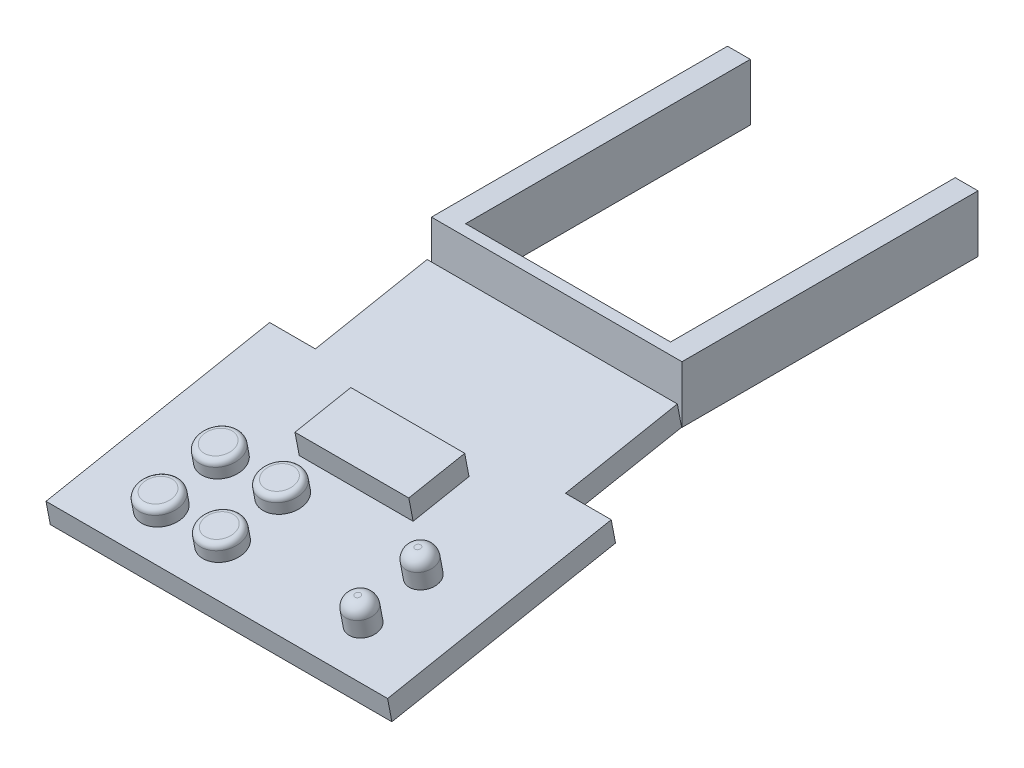
ISO-10303-21;
HEADER;
FILE_DESCRIPTION(('STEP AP214'),'2;1');
FILE_NAME('part.step','',(''),(''),'','','');
FILE_SCHEMA(('AUTOMOTIVE_DESIGN { 1 0 10303 214 1 1 1 1 }'));
ENDSEC;
DATA;
#1=APPLICATION_CONTEXT('core data for automotive mechanical design processes');
#2=APPLICATION_PROTOCOL_DEFINITION('international standard','automotive_design',2000,#1);
#3=PRODUCT_CONTEXT('',#1,'mechanical');
#4=PRODUCT('Part','Part','',(#3));
#5=PRODUCT_RELATED_PRODUCT_CATEGORY('part','',(#4));
#6=PRODUCT_DEFINITION_FORMATION('','',#4);
#7=PRODUCT_DEFINITION_CONTEXT('part definition',#1,'design');
#8=PRODUCT_DEFINITION('design','',#6,#7);
#9=PRODUCT_DEFINITION_SHAPE('','',#8);
#10=(LENGTH_UNIT() NAMED_UNIT(*) SI_UNIT(.MILLI.,.METRE.));
#11=(NAMED_UNIT(*) PLANE_ANGLE_UNIT() SI_UNIT($,.RADIAN.));
#12=(NAMED_UNIT(*) SI_UNIT($,.STERADIAN.) SOLID_ANGLE_UNIT());
#13=UNCERTAINTY_MEASURE_WITH_UNIT(LENGTH_MEASURE(1.E-05),#10,'distance_accuracy_value','');
#14=(GEOMETRIC_REPRESENTATION_CONTEXT(3) GLOBAL_UNCERTAINTY_ASSIGNED_CONTEXT((#13)) GLOBAL_UNIT_ASSIGNED_CONTEXT((#10,
#11,#12)) REPRESENTATION_CONTEXT('',''));
#15=CARTESIAN_POINT('',(0.,0.,0.));
#16=DIRECTION('',(0.,0.,1.));
#17=DIRECTION('',(1.,0.,0.));
#18=AXIS2_PLACEMENT_3D('',#15,#16,#17);
#19=CARTESIAN_POINT('',(0.,9.26484620320237,1.78170119292353));
#20=DIRECTION('',(0.,0.982006446980648,0.188847393650125));
#21=DIRECTION('',(0.,-0.188847393650124,0.982006446980647));
#22=AXIS2_PLACEMENT_3D('',#19,#20,#21);
#23=PLANE('',#22);
#24=CARTESIAN_POINT('',(18.0023654325447,-3.89618109443994,70.2190431406636));
#25=DIRECTION('',(0.,0.982006446980647,0.188847393650124));
#26=DIRECTION('',(0.,-0.188847393650124,0.982006446980647));
#27=AXIS2_PLACEMENT_3D('',#24,#25,#26);
#28=CIRCLE('',#27,2.5);
#29=CARTESIAN_POINT('',(18.0023654325447,-4.36829957856525,72.6740592581152));
#30=VERTEX_POINT('',#29);
#31=EDGE_CURVE('E590',#30,#30,#28,.T.);
#32=ORIENTED_EDGE('',*,*,#31,.F.);
#33=EDGE_LOOP('',(#32));
#34=FACE_BOUND('',#33,.T.);
#35=CARTESIAN_POINT('',(18.0023654325447,-5.92774308482148,80.7831654906475));
#36=DIRECTION('',(0.,0.982006446980647,0.188847393650124));
#37=DIRECTION('',(0.,-0.188847393650124,0.982006446980647));
#38=AXIS2_PLACEMENT_3D('',#35,#36,#37);
#39=CIRCLE('',#38,2.5);
#40=CARTESIAN_POINT('',(18.0023654325447,-6.39986156894679,83.2381816080992));
#41=VERTEX_POINT('',#40);
#42=EDGE_CURVE('E591',#41,#41,#39,.T.);
#43=ORIENTED_EDGE('',*,*,#42,.F.);
#44=EDGE_LOOP('',(#43));
#45=FACE_BOUND('',#44,.T.);
#46=CARTESIAN_POINT('',(-6.69486984818654,-5.92774308482148,80.7831654906475));
#47=DIRECTION('',(0.,0.982006446980647,0.188847393650124));
#48=DIRECTION('',(0.,-0.188847393650124,0.982006446980647));
#49=AXIS2_PLACEMENT_3D('',#46,#47,#48);
#50=CIRCLE('',#49,3.5);
#51=CARTESIAN_POINT('',(-6.69486984818654,-6.58870896259691,84.2201880550798));
#52=VERTEX_POINT('',#51);
#53=EDGE_CURVE('E594',#52,#52,#50,.T.);
#54=ORIENTED_EDGE('',*,*,#53,.F.);
#55=EDGE_LOOP('',(#54));
#56=FACE_BOUND('',#55,.T.);
#57=CARTESIAN_POINT('',(-17.4525612894866,-5.92774308482148,80.7831654906475));
#58=DIRECTION('',(0.,0.982006446980647,0.188847393650124));
#59=DIRECTION('',(0.,-0.188847393650124,0.982006446980647));
#60=AXIS2_PLACEMENT_3D('',#57,#58,#59);
#61=CIRCLE('',#60,3.5);
#62=CARTESIAN_POINT('',(-17.4525612894866,-6.58870896259691,84.2201880550798));
#63=VERTEX_POINT('',#62);
#64=EDGE_CURVE('E599',#63,#63,#61,.T.);
#65=ORIENTED_EDGE('',*,*,#64,.F.);
#66=EDGE_LOOP('',(#65));
#67=FACE_BOUND('',#66,.T.);
#68=CARTESIAN_POINT('',(-17.4525612894866,-3.89618109443994,70.2190431406636));
#69=DIRECTION('',(0.,0.982006446980647,0.188847393650124));
#70=DIRECTION('',(0.,-0.188847393650124,0.982006446980647));
#71=AXIS2_PLACEMENT_3D('',#68,#69,#70);
#72=CIRCLE('',#71,3.5);
#73=CARTESIAN_POINT('',(-17.4525612894866,-4.55714697221538,73.6560657050958));
#74=VERTEX_POINT('',#73);
#75=EDGE_CURVE('E602',#74,#74,#72,.T.);
#76=ORIENTED_EDGE('',*,*,#75,.F.);
#77=EDGE_LOOP('',(#76));
#78=FACE_BOUND('',#77,.T.);
#79=CARTESIAN_POINT('',(-6.69486984818654,-3.89618109443994,70.2190431406636));
#80=DIRECTION('',(0.,0.982006446980647,0.188847393650124));
#81=DIRECTION('',(0.,-0.188847393650124,0.982006446980647));
#82=AXIS2_PLACEMENT_3D('',#79,#80,#81);
#83=CIRCLE('',#82,3.5);
#84=CARTESIAN_POINT('',(-6.69486984818654,-4.55714697221538,73.6560657050958));
#85=VERTEX_POINT('',#84);
#86=EDGE_CURVE('E605',#85,#85,#83,.T.);
#87=ORIENTED_EDGE('',*,*,#86,.F.);
#88=EDGE_LOOP('',(#87));
#89=FACE_BOUND('',#88,.T.);
#90=DIRECTION('',(0.,-0.188847393650124,0.982006446980647));
#91=VECTOR('',#90,1.);
#92=CARTESIAN_POINT('',(21.9437370196044,9.26484620320237,1.78170119292353));
#93=LINE('',#92,#91);
#94=CARTESIAN_POINT('',(21.9437370196044,3.9280257879226,29.5331673523784));
#95=VERTEX_POINT('',#94);
#96=CARTESIAN_POINT('',(21.9437370196044,0.151077914920107,49.1732962919913));
#97=VERTEX_POINT('',#96);
#98=EDGE_CURVE('E170',#95,#97,#93,.T.);
#99=ORIENTED_EDGE('',*,*,#98,.F.);
#100=DIRECTION('',(1.,0.,0.));
#101=VECTOR('',#100,1.);
#102=CARTESIAN_POINT('',(0.,3.9280257879226,29.5331673523784));
#103=LINE('',#102,#101);
#104=CARTESIAN_POINT('',(-21.9999999999999,3.9280257879226,29.5331673523784));
#105=VERTEX_POINT('',#104);
#106=EDGE_CURVE('E173',#105,#95,#103,.T.);
#107=ORIENTED_EDGE('',*,*,#106,.F.);
#108=DIRECTION('',(0.,-0.188847393650124,0.982006446980647));
#109=VECTOR('',#108,1.);
#110=CARTESIAN_POINT('',(-21.9999999999999,9.26484620320237,1.78170119292354));
#111=LINE('',#110,#109);
#112=CARTESIAN_POINT('',(-21.9999999999999,0.151077914920108,49.1732962919913));
#113=VERTEX_POINT('',#112);
#114=EDGE_CURVE('E177',#105,#113,#111,.T.);
#115=ORIENTED_EDGE('',*,*,#114,.T.);
#116=DIRECTION('',(1.,0.,0.));
#117=VECTOR('',#116,1.);
#118=CARTESIAN_POINT('',(0.,0.151077914920107,49.1732962919913));
#119=LINE('',#118,#117);
#120=CARTESIAN_POINT('',(-30.0281314901977,0.151077914920107,49.1732962919913));
#121=VERTEX_POINT('',#120);
#122=EDGE_CURVE('E179',#121,#113,#119,.T.);
#123=ORIENTED_EDGE('',*,*,#122,.F.);
#124=DIRECTION('',(0.,-0.188847393650124,0.982006446980647));
#125=VECTOR('',#124,1.);
#126=CARTESIAN_POINT('',(-30.0281314901978,9.26484620320237,1.78170119292354));
#127=LINE('',#126,#125);
#128=CARTESIAN_POINT('',(-30.0281314901977,-7.40281783108487,88.4535541712172));
#129=VERTEX_POINT('',#128);
#130=EDGE_CURVE('E182',#121,#129,#127,.T.);
#131=ORIENTED_EDGE('',*,*,#130,.T.);
#132=DIRECTION('',(1.,0.,0.));
#133=VECTOR('',#132,1.);
#134=CARTESIAN_POINT('',(0.,-7.40281783108488,88.4535541712172));
#135=LINE('',#134,#133);
#136=CARTESIAN_POINT('',(29.9718685098023,-7.40281783108488,88.4535541712172));
#137=VERTEX_POINT('',#136);
#138=EDGE_CURVE('E185',#129,#137,#135,.T.);
#139=ORIENTED_EDGE('',*,*,#138,.T.);
#140=DIRECTION('',(0.,-0.188847393650124,0.982006446980647));
#141=VECTOR('',#140,1.);
#142=CARTESIAN_POINT('',(29.9718685098023,9.26484620320237,1.78170119292353));
#143=LINE('',#142,#141);
#144=CARTESIAN_POINT('',(29.9718685098023,0.151077914920107,49.1732962919913));
#145=VERTEX_POINT('',#144);
#146=EDGE_CURVE('E187',#145,#137,#143,.T.);
#147=ORIENTED_EDGE('',*,*,#146,.F.);
#148=EDGE_CURVE('E183',#97,#145,#119,.T.);
#149=ORIENTED_EDGE('',*,*,#148,.F.);
#150=EDGE_LOOP('',(#99,#107,#115,#123,#131,#139,#147,#149));
#151=FACE_BOUND('',#150,.T.);
#152=DIRECTION('',(1.,0.,0.));
#153=VECTOR('',#152,1.);
#154=CARTESIAN_POINT('',(-10.0281314901977,-2.69439172162923,63.9697384020479));
#155=LINE('',#154,#153);
#156=CARTESIAN_POINT('',(-10.0281314901977,-2.69439172162923,63.9697384020479));
#157=VERTEX_POINT('',#156);
#158=CARTESIAN_POINT('',(9.97186850980225,-2.69439172162923,63.9697384020479));
#159=VERTEX_POINT('',#158);
#160=EDGE_CURVE('E65',#157,#159,#155,.T.);
#161=ORIENTED_EDGE('',*,*,#160,.F.);
#162=DIRECTION('',(0.,-0.188847393650125,0.982006446980647));
#163=VECTOR('',#162,1.);
#164=CARTESIAN_POINT('',(-10.0281314901977,-0.805917785127988,54.1496739322414));
#165=LINE('',#164,#163);
#166=CARTESIAN_POINT('',(-10.0281314901977,-0.805917785127988,54.1496739322414));
#167=VERTEX_POINT('',#166);
#168=EDGE_CURVE('E160',#167,#157,#165,.T.);
#169=ORIENTED_EDGE('',*,*,#168,.F.);
#170=DIRECTION('',(1.,0.,0.));
#171=VECTOR('',#170,1.);
#172=CARTESIAN_POINT('',(-10.0281314901977,-0.805917785127988,54.1496739322414));
#173=LINE('',#172,#171);
#174=CARTESIAN_POINT('',(9.97186850980226,-0.805917785127989,54.1496739322414));
#175=VERTEX_POINT('',#174);
#176=EDGE_CURVE('E157',#167,#175,#173,.T.);
#177=ORIENTED_EDGE('',*,*,#176,.T.);
#178=DIRECTION('',(0.,-0.188847393650125,0.982006446980647));
#179=VECTOR('',#178,1.);
#180=CARTESIAN_POINT('',(9.97186850980226,-0.805917785127987,54.1496739322414));
#181=LINE('',#180,#179);
#182=EDGE_CURVE('E70',#175,#159,#181,.T.);
#183=ORIENTED_EDGE('',*,*,#182,.T.);
#184=EDGE_LOOP('',(#161,#169,#177,#183));
#185=FACE_BOUND('',#184,.T.);
#186=ADVANCED_FACE('F50',(#34,#45,#56,#67,#78,#89,#151,#185),#23,.T.);
#187=CARTESIAN_POINT('',(21.9437370196044,9.26484620320237,1.78170119292353));
#188=DIRECTION('',(1.,0.,0.));
#189=DIRECTION('',(0.,0.,-1.));
#190=AXIS2_PLACEMENT_3D('',#187,#188,#189);
#191=PLANE('',#190);
#192=DIRECTION('',(0.,-0.188847393650124,0.982006446980647));
#193=VECTOR('',#192,1.);
#194=CARTESIAN_POINT('',(21.9437370196044,5.33682041527978,1.02631161832303));
#195=LINE('',#194,#193);
#196=CARTESIAN_POINT('',(21.9437370196044,0.,28.7777777777779));
#197=VERTEX_POINT('',#196);
#198=CARTESIAN_POINT('',(21.9437370196044,-3.77694787300248,48.4179067173908));
#199=VERTEX_POINT('',#198);
#200=EDGE_CURVE('E161',#197,#199,#195,.T.);
#201=ORIENTED_EDGE('',*,*,#200,.F.);
#202=DIRECTION('',(0.,-0.982006446980648,-0.188847393650124));
#203=VECTOR('',#202,1.);
#204=CARTESIAN_POINT('',(21.9437370196044,3.9280257879226,29.5331673523784));
#205=LINE('',#204,#203);
#206=EDGE_CURVE('E221',#95,#197,#205,.T.);
#207=ORIENTED_EDGE('',*,*,#206,.F.);
#208=ORIENTED_EDGE('',*,*,#98,.T.);
#209=DIRECTION('',(0.,-0.982006446980648,-0.188847393650124));
#210=VECTOR('',#209,1.);
#211=CARTESIAN_POINT('',(21.9437370196044,0.151077914920107,49.1732962919913));
#212=LINE('',#211,#210);
#213=EDGE_CURVE('E206',#97,#199,#212,.T.);
#214=ORIENTED_EDGE('',*,*,#213,.T.);
#215=EDGE_LOOP('',(#201,#207,#208,#214));
#216=FACE_BOUND('',#215,.T.);
#217=ADVANCED_FACE('F267',(#216),#191,.T.);
#218=CARTESIAN_POINT('',(0.,3.9280257879226,29.5331673523784));
#219=DIRECTION('',(0.,0.188847393650124,-0.982006446980648));
#220=DIRECTION('',(0.,0.982006446980647,0.188847393650124));
#221=AXIS2_PLACEMENT_3D('',#218,#219,#220);
#222=PLANE('',#221);
#223=DIRECTION('',(1.,0.,0.));
#224=VECTOR('',#223,1.);
#225=CARTESIAN_POINT('',(0.,0.,28.7777777777779));
#226=LINE('',#225,#224);
#227=CARTESIAN_POINT('',(-21.9999999999999,0.,28.7777777777779));
#228=VERTEX_POINT('',#227);
#229=EDGE_CURVE('E164',#228,#197,#226,.T.);
#230=ORIENTED_EDGE('',*,*,#229,.F.);
#231=DIRECTION('',(0.,-0.982006446980648,-0.188847393650124));
#232=VECTOR('',#231,1.);
#233=CARTESIAN_POINT('',(-21.9999999999999,3.9280257879226,29.5331673523784));
#234=LINE('',#233,#232);
#235=EDGE_CURVE('E219',#105,#228,#234,.T.);
#236=ORIENTED_EDGE('',*,*,#235,.F.);
#237=ORIENTED_EDGE('',*,*,#106,.T.);
#238=ORIENTED_EDGE('',*,*,#206,.T.);
#239=EDGE_LOOP('',(#230,#236,#237,#238));
#240=FACE_BOUND('',#239,.T.);
#241=ADVANCED_FACE('F273',(#240),#222,.T.);
#242=CARTESIAN_POINT('',(-21.9999999999999,9.26484620320237,1.78170119292354));
#243=DIRECTION('',(1.,0.,0.));
#244=DIRECTION('',(0.,0.,-1.));
#245=AXIS2_PLACEMENT_3D('',#242,#243,#244);
#246=PLANE('',#245);
#247=DIRECTION('',(0.,-0.188847393650124,0.982006446980647));
#248=VECTOR('',#247,1.);
#249=CARTESIAN_POINT('',(-21.9999999999999,5.33682041527978,1.02631161832304));
#250=LINE('',#249,#248);
#251=CARTESIAN_POINT('',(-21.9999999999999,-3.77694787300248,48.4179067173908));
#252=VERTEX_POINT('',#251);
#253=EDGE_CURVE('E192',#228,#252,#250,.T.);
#254=ORIENTED_EDGE('',*,*,#253,.T.);
#255=DIRECTION('',(0.,-0.982006446980648,-0.188847393650124));
#256=VECTOR('',#255,1.);
#257=CARTESIAN_POINT('',(-21.9999999999999,0.151077914920108,49.1732962919913));
#258=LINE('',#257,#256);
#259=EDGE_CURVE('E217',#113,#252,#258,.T.);
#260=ORIENTED_EDGE('',*,*,#259,.F.);
#261=ORIENTED_EDGE('',*,*,#114,.F.);
#262=ORIENTED_EDGE('',*,*,#235,.T.);
#263=EDGE_LOOP('',(#254,#260,#261,#262));
#264=FACE_BOUND('',#263,.T.);
#265=ADVANCED_FACE('F302',(#264),#246,.F.);
#266=CARTESIAN_POINT('',(0.,0.151077914920107,49.1732962919913));
#267=DIRECTION('',(0.,0.188847393650124,-0.982006446980648));
#268=DIRECTION('',(0.,0.982006446980647,0.188847393650124));
#269=AXIS2_PLACEMENT_3D('',#266,#267,#268);
#270=PLANE('',#269);
#271=DIRECTION('',(1.,0.,0.));
#272=VECTOR('',#271,1.);
#273=CARTESIAN_POINT('',(0.,-3.77694787300248,48.4179067173908));
#274=LINE('',#273,#272);
#275=CARTESIAN_POINT('',(-30.0281314901977,-3.77694787300248,48.4179067173908));
#276=VERTEX_POINT('',#275);
#277=EDGE_CURVE('E195',#276,#252,#274,.T.);
#278=ORIENTED_EDGE('',*,*,#277,.F.);
#279=DIRECTION('',(0.,-0.982006446980648,-0.188847393650124));
#280=VECTOR('',#279,1.);
#281=CARTESIAN_POINT('',(-30.0281314901977,0.151077914920107,49.1732962919913));
#282=LINE('',#281,#280);
#283=EDGE_CURVE('E215',#121,#276,#282,.T.);
#284=ORIENTED_EDGE('',*,*,#283,.F.);
#285=ORIENTED_EDGE('',*,*,#122,.T.);
#286=ORIENTED_EDGE('',*,*,#259,.T.);
#287=EDGE_LOOP('',(#278,#284,#285,#286));
#288=FACE_BOUND('',#287,.T.);
#289=ADVANCED_FACE('F290',(#288),#270,.T.);
#290=CARTESIAN_POINT('',(-30.0281314901978,9.26484620320237,1.78170119292354));
#291=DIRECTION('',(1.,0.,0.));
#292=DIRECTION('',(0.,0.,-1.));
#293=AXIS2_PLACEMENT_3D('',#290,#291,#292);
#294=PLANE('',#293);
#295=DIRECTION('',(0.,-0.188847393650124,0.982006446980647));
#296=VECTOR('',#295,1.);
#297=CARTESIAN_POINT('',(-30.0281314901978,5.33682041527978,1.02631161832304));
#298=LINE('',#297,#296);
#299=CARTESIAN_POINT('',(-30.0281314901977,-11.3308436190075,87.6981645966167));
#300=VERTEX_POINT('',#299);
#301=EDGE_CURVE('E198',#276,#300,#298,.T.);
#302=ORIENTED_EDGE('',*,*,#301,.T.);
#303=DIRECTION('',(0.,-0.982006446980648,-0.188847393650124));
#304=VECTOR('',#303,1.);
#305=CARTESIAN_POINT('',(-30.0281314901977,-7.40281783108487,88.4535541712172));
#306=LINE('',#305,#304);
#307=EDGE_CURVE('E212',#129,#300,#306,.T.);
#308=ORIENTED_EDGE('',*,*,#307,.F.);
#309=ORIENTED_EDGE('',*,*,#130,.F.);
#310=ORIENTED_EDGE('',*,*,#283,.T.);
#311=EDGE_LOOP('',(#302,#308,#309,#310));
#312=FACE_BOUND('',#311,.T.);
#313=ADVANCED_FACE('F297',(#312),#294,.F.);
#314=CARTESIAN_POINT('',(0.,-7.40281783108488,88.4535541712172));
#315=DIRECTION('',(0.,0.188847393650124,-0.982006446980648));
#316=DIRECTION('',(0.,0.982006446980647,0.188847393650124));
#317=AXIS2_PLACEMENT_3D('',#314,#315,#316);
#318=PLANE('',#317);
#319=DIRECTION('',(1.,0.,0.));
#320=VECTOR('',#319,1.);
#321=CARTESIAN_POINT('',(0.,-11.3308436190075,87.6981645966167));
#322=LINE('',#321,#320);
#323=CARTESIAN_POINT('',(29.9718685098023,-11.3308436190075,87.6981645966167));
#324=VERTEX_POINT('',#323);
#325=EDGE_CURVE('E200',#300,#324,#322,.T.);
#326=ORIENTED_EDGE('',*,*,#325,.T.);
#327=DIRECTION('',(0.,-0.982006446980648,-0.188847393650124));
#328=VECTOR('',#327,1.);
#329=CARTESIAN_POINT('',(29.9718685098023,-7.40281783108488,88.4535541712172));
#330=LINE('',#329,#328);
#331=EDGE_CURVE('E210',#137,#324,#330,.T.);
#332=ORIENTED_EDGE('',*,*,#331,.F.);
#333=ORIENTED_EDGE('',*,*,#138,.F.);
#334=ORIENTED_EDGE('',*,*,#307,.T.);
#335=EDGE_LOOP('',(#326,#332,#333,#334));
#336=FACE_BOUND('',#335,.T.);
#337=ADVANCED_FACE('F293',(#336),#318,.F.);
#338=CARTESIAN_POINT('',(29.9718685098023,9.26484620320237,1.78170119292353));
#339=DIRECTION('',(1.,0.,0.));
#340=DIRECTION('',(0.,0.,-1.));
#341=AXIS2_PLACEMENT_3D('',#338,#339,#340);
#342=PLANE('',#341);
#343=DIRECTION('',(0.,-0.188847393650124,0.982006446980647));
#344=VECTOR('',#343,1.);
#345=CARTESIAN_POINT('',(29.9718685098023,5.33682041527978,1.02631161832303));
#346=LINE('',#345,#344);
#347=CARTESIAN_POINT('',(29.9718685098023,-3.77694787300248,48.4179067173908));
#348=VERTEX_POINT('',#347);
#349=EDGE_CURVE('E203',#348,#324,#346,.T.);
#350=ORIENTED_EDGE('',*,*,#349,.F.);
#351=DIRECTION('',(0.,-0.982006446980648,-0.188847393650124));
#352=VECTOR('',#351,1.);
#353=CARTESIAN_POINT('',(29.9718685098023,0.151077914920107,49.1732962919913));
#354=LINE('',#353,#352);
#355=EDGE_CURVE('E208',#145,#348,#354,.T.);
#356=ORIENTED_EDGE('',*,*,#355,.F.);
#357=ORIENTED_EDGE('',*,*,#146,.T.);
#358=ORIENTED_EDGE('',*,*,#331,.T.);
#359=EDGE_LOOP('',(#350,#356,#357,#358));
#360=FACE_BOUND('',#359,.T.);
#361=ADVANCED_FACE('F288',(#360),#342,.T.);
#362=EDGE_CURVE('E174',#199,#348,#274,.T.);
#363=ORIENTED_EDGE('',*,*,#362,.F.);
#364=ORIENTED_EDGE('',*,*,#213,.F.);
#365=ORIENTED_EDGE('',*,*,#148,.T.);
#366=ORIENTED_EDGE('',*,*,#355,.T.);
#367=EDGE_LOOP('',(#363,#364,#365,#366));
#368=FACE_BOUND('',#367,.T.);
#369=ADVANCED_FACE('F284',(#368),#270,.T.);
#370=CARTESIAN_POINT('',(0.,5.33682041527978,1.02631161832303));
#371=DIRECTION('',(0.,0.982006446980648,0.188847393650125));
#372=DIRECTION('',(0.,-0.188847393650124,0.982006446980647));
#373=AXIS2_PLACEMENT_3D('',#370,#371,#372);
#374=PLANE('',#373);
#375=ORIENTED_EDGE('',*,*,#200,.T.);
#376=ORIENTED_EDGE('',*,*,#362,.T.);
#377=ORIENTED_EDGE('',*,*,#349,.T.);
#378=ORIENTED_EDGE('',*,*,#325,.F.);
#379=ORIENTED_EDGE('',*,*,#301,.F.);
#380=ORIENTED_EDGE('',*,*,#277,.T.);
#381=ORIENTED_EDGE('',*,*,#253,.F.);
#382=ORIENTED_EDGE('',*,*,#229,.T.);
#383=EDGE_LOOP('',(#375,#376,#377,#378,#379,#380,#381,#382));
#384=FACE_BOUND('',#383,.T.);
#385=ADVANCED_FACE('F281',(#384),#374,.F.);
#386=CARTESIAN_POINT('',(-10.0281314901977,3.1221080027946,54.9050635068419));
#387=DIRECTION('',(1.,0.,0.));
#388=DIRECTION('',(0.,0.,-1.));
#389=AXIS2_PLACEMENT_3D('',#386,#387,#388);
#390=PLANE('',#389);
#391=ORIENTED_EDGE('',*,*,#168,.T.);
#392=DIRECTION('',(0.,-0.982006446980648,-0.188847393650124));
#393=VECTOR('',#392,1.);
#394=CARTESIAN_POINT('',(-10.0281314901977,1.23363406629336,64.7251279766484));
#395=LINE('',#394,#393);
#396=CARTESIAN_POINT('',(-10.0281314901977,1.23363406629336,64.7251279766484));
#397=VERTEX_POINT('',#396);
#398=EDGE_CURVE('E141',#397,#157,#395,.T.);
#399=ORIENTED_EDGE('',*,*,#398,.F.);
#400=DIRECTION('',(0.,-0.188847393650125,0.982006446980647));
#401=VECTOR('',#400,1.);
#402=CARTESIAN_POINT('',(-10.0281314901977,3.1221080027946,54.9050635068419));
#403=LINE('',#402,#401);
#404=CARTESIAN_POINT('',(-10.0281314901977,3.1221080027946,54.9050635068419));
#405=VERTEX_POINT('',#404);
#406=EDGE_CURVE('E148',#405,#397,#403,.T.);
#407=ORIENTED_EDGE('',*,*,#406,.F.);
#408=DIRECTION('',(0.,-0.982006446980648,-0.188847393650124));
#409=VECTOR('',#408,1.);
#410=CARTESIAN_POINT('',(-10.0281314901977,3.1221080027946,54.9050635068419));
#411=LINE('',#410,#409);
#412=EDGE_CURVE('E610',#405,#167,#411,.T.);
#413=ORIENTED_EDGE('',*,*,#412,.T.);
#414=EDGE_LOOP('',(#391,#399,#407,#413));
#415=FACE_BOUND('',#414,.T.);
#416=ADVANCED_FACE('F159',(#415),#390,.F.);
#417=CARTESIAN_POINT('',(-10.0281314901977,1.23363406629336,64.7251279766484));
#418=DIRECTION('',(0.,0.188847393650124,-0.982006446980648));
#419=DIRECTION('',(0.,0.982006446980647,0.188847393650124));
#420=AXIS2_PLACEMENT_3D('',#417,#418,#419);
#421=PLANE('',#420);
#422=ORIENTED_EDGE('',*,*,#160,.T.);
#423=DIRECTION('',(0.,-0.982006446980648,-0.188847393650124));
#424=VECTOR('',#423,1.);
#425=CARTESIAN_POINT('',(9.97186850980225,1.23363406629336,64.7251279766484));
#426=LINE('',#425,#424);
#427=CARTESIAN_POINT('',(9.97186850980225,1.23363406629336,64.7251279766484));
#428=VERTEX_POINT('',#427);
#429=EDGE_CURVE('E143',#428,#159,#426,.T.);
#430=ORIENTED_EDGE('',*,*,#429,.F.);
#431=DIRECTION('',(1.,0.,0.));
#432=VECTOR('',#431,1.);
#433=CARTESIAN_POINT('',(-10.0281314901977,1.23363406629336,64.7251279766484));
#434=LINE('',#433,#432);
#435=EDGE_CURVE('E137',#397,#428,#434,.T.);
#436=ORIENTED_EDGE('',*,*,#435,.F.);
#437=ORIENTED_EDGE('',*,*,#398,.T.);
#438=EDGE_LOOP('',(#422,#430,#436,#437));
#439=FACE_BOUND('',#438,.T.);
#440=ADVANCED_FACE('F139',(#439),#421,.F.);
#441=CARTESIAN_POINT('',(9.97186850980226,3.1221080027946,54.9050635068419));
#442=DIRECTION('',(1.,0.,0.));
#443=DIRECTION('',(0.,0.,-1.));
#444=AXIS2_PLACEMENT_3D('',#441,#442,#443);
#445=PLANE('',#444);
#446=ORIENTED_EDGE('',*,*,#182,.F.);
#447=DIRECTION('',(0.,-0.982006446980648,-0.188847393650124));
#448=VECTOR('',#447,1.);
#449=CARTESIAN_POINT('',(9.97186850980226,3.1221080027946,54.9050635068419));
#450=LINE('',#449,#448);
#451=CARTESIAN_POINT('',(9.97186850980226,3.1221080027946,54.9050635068419));
#452=VERTEX_POINT('',#451);
#453=EDGE_CURVE('E166',#452,#175,#450,.T.);
#454=ORIENTED_EDGE('',*,*,#453,.F.);
#455=DIRECTION('',(0.,-0.188847393650125,0.982006446980647));
#456=VECTOR('',#455,1.);
#457=CARTESIAN_POINT('',(9.97186850980226,3.1221080027946,54.9050635068419));
#458=LINE('',#457,#456);
#459=EDGE_CURVE('E147',#452,#428,#458,.T.);
#460=ORIENTED_EDGE('',*,*,#459,.T.);
#461=ORIENTED_EDGE('',*,*,#429,.T.);
#462=EDGE_LOOP('',(#446,#454,#460,#461));
#463=FACE_BOUND('',#462,.T.);
#464=ADVANCED_FACE('F372',(#463),#445,.T.);
#465=CARTESIAN_POINT('',(-10.0281314901977,3.1221080027946,54.9050635068419));
#466=DIRECTION('',(0.,0.188847393650124,-0.982006446980648));
#467=DIRECTION('',(0.,0.982006446980647,0.188847393650124));
#468=AXIS2_PLACEMENT_3D('',#465,#466,#467);
#469=PLANE('',#468);
#470=ORIENTED_EDGE('',*,*,#176,.F.);
#471=ORIENTED_EDGE('',*,*,#412,.F.);
#472=DIRECTION('',(1.,0.,0.));
#473=VECTOR('',#472,1.);
#474=CARTESIAN_POINT('',(-10.0281314901977,3.1221080027946,54.9050635068419));
#475=LINE('',#474,#473);
#476=EDGE_CURVE('E154',#405,#452,#475,.T.);
#477=ORIENTED_EDGE('',*,*,#476,.T.);
#478=ORIENTED_EDGE('',*,*,#453,.T.);
#479=EDGE_LOOP('',(#470,#471,#477,#478));
#480=FACE_BOUND('',#479,.T.);
#481=ADVANCED_FACE('F369',(#480),#469,.T.);
#482=CARTESIAN_POINT('',(0.,13.192871991125,2.53709076752403));
#483=DIRECTION('',(0.,0.982006446980647,0.188847393650125));
#484=DIRECTION('',(0.,-0.188847393650125,0.982006446980647));
#485=AXIS2_PLACEMENT_3D('',#482,#483,#484);
#486=PLANE('',#485);
#487=ORIENTED_EDGE('',*,*,#406,.T.);
#488=ORIENTED_EDGE('',*,*,#435,.T.);
#489=ORIENTED_EDGE('',*,*,#459,.F.);
#490=ORIENTED_EDGE('',*,*,#476,.F.);
#491=EDGE_LOOP('',(#487,#488,#489,#490));
#492=FACE_BOUND('',#491,.T.);
#493=ADVANCED_FACE('F152',(#492),#486,.T.);
#494=CARTESIAN_POINT('',(-6.69486984818654,-0.950161753498,70.7855853216139));
#495=DIRECTION('',(0.,-0.982006446980647,-0.188847393650124));
#496=DIRECTION('',(0.,0.188847393650125,-0.982006446980647));
#497=AXIS2_PLACEMENT_3D('',#494,#495,#496);
#498=CYLINDRICAL_SURFACE('',#497,3.5);
#499=CARTESIAN_POINT('',(-6.69486984818654,-1.93216820047864,70.5967379279638));
#500=DIRECTION('',(0.,0.982006446980647,0.188847393650124));
#501=DIRECTION('',(0.,-0.188847393650124,0.982006446980647));
#502=AXIS2_PLACEMENT_3D('',#499,#500,#501);
#503=CIRCLE('',#502,3.5);
#504=CARTESIAN_POINT('',(-6.69486984818654,-2.59313407825408,74.0337604923961));
#505=VERTEX_POINT('',#504);
#506=EDGE_CURVE('E250',#505,#505,#503,.F.);
#507=ORIENTED_EDGE('',*,*,#506,.T.);
#508=EDGE_LOOP('',(#507));
#509=FACE_BOUND('',#508,.T.);
#510=ORIENTED_EDGE('',*,*,#86,.T.);
#511=EDGE_LOOP('',(#510));
#512=FACE_BOUND('',#511,.T.);
#513=ADVANCED_FACE('F362',(#509,#512),#498,.T.);
#514=CARTESIAN_POINT('',(-6.69486984818654,-0.950161753498,70.7855853216139));
#515=DIRECTION('',(0.,0.982006446980647,0.188847393650124));
#516=DIRECTION('',(0.,-0.188847393650124,0.982006446980647));
#517=AXIS2_PLACEMENT_3D('',#514,#515,#516);
#518=PLANE('',#517);
#519=CARTESIAN_POINT('',(-6.69486984818654,-0.950161753498001,70.7855853216139));
#520=DIRECTION('',(0.,0.982006446980647,0.188847393650124));
#521=DIRECTION('',(0.,-0.188847393650124,0.982006446980647));
#522=AXIS2_PLACEMENT_3D('',#519,#520,#521);
#523=CIRCLE('',#522,2.5);
#524=CARTESIAN_POINT('',(-6.69486984818654,-1.42228023762331,73.2406014390656));
#525=VERTEX_POINT('',#524);
#526=EDGE_CURVE('E247',#525,#525,#523,.T.);
#527=ORIENTED_EDGE('',*,*,#526,.T.);
#528=EDGE_LOOP('',(#527));
#529=FACE_BOUND('',#528,.T.);
#530=ADVANCED_FACE('F358',(#529),#518,.T.);
#531=CARTESIAN_POINT('',(-17.4525612894866,-0.950161753498,70.7855853216139));
#532=DIRECTION('',(0.,-0.982006446980647,-0.188847393650124));
#533=DIRECTION('',(0.,0.188847393650125,-0.982006446980647));
#534=AXIS2_PLACEMENT_3D('',#531,#532,#533);
#535=CYLINDRICAL_SURFACE('',#534,3.5);
#536=CARTESIAN_POINT('',(-17.4525612894866,-1.93216820047864,70.5967379279638));
#537=DIRECTION('',(0.,0.982006446980647,0.188847393650124));
#538=DIRECTION('',(0.,-0.188847393650124,0.982006446980647));
#539=AXIS2_PLACEMENT_3D('',#536,#537,#538);
#540=CIRCLE('',#539,3.5);
#541=CARTESIAN_POINT('',(-17.4525612894866,-2.59313407825408,74.0337604923961));
#542=VERTEX_POINT('',#541);
#543=EDGE_CURVE('E12',#542,#542,#540,.F.);
#544=ORIENTED_EDGE('',*,*,#543,.T.);
#545=EDGE_LOOP('',(#544));
#546=FACE_BOUND('',#545,.T.);
#547=ORIENTED_EDGE('',*,*,#75,.T.);
#548=EDGE_LOOP('',(#547));
#549=FACE_BOUND('',#548,.T.);
#550=ADVANCED_FACE('F355',(#546,#549),#535,.T.);
#551=CARTESIAN_POINT('',(-17.4525612894866,-0.950161753498,70.7855853216139));
#552=DIRECTION('',(0.,0.982006446980647,0.188847393650124));
#553=DIRECTION('',(0.,-0.188847393650124,0.982006446980647));
#554=AXIS2_PLACEMENT_3D('',#551,#552,#553);
#555=PLANE('',#554);
#556=CARTESIAN_POINT('',(-17.4525612894866,-0.950161753498001,70.7855853216139));
#557=DIRECTION('',(0.,0.982006446980647,0.188847393650124));
#558=DIRECTION('',(0.,-0.188847393650124,0.982006446980647));
#559=AXIS2_PLACEMENT_3D('',#556,#557,#558);
#560=CIRCLE('',#559,2.5);
#561=CARTESIAN_POINT('',(-17.4525612894866,-1.42228023762331,73.2406014390656));
#562=VERTEX_POINT('',#561);
#563=EDGE_CURVE('E58',#562,#562,#560,.T.);
#564=ORIENTED_EDGE('',*,*,#563,.T.);
#565=EDGE_LOOP('',(#564));
#566=FACE_BOUND('',#565,.T.);
#567=ADVANCED_FACE('F255',(#566),#555,.T.);
#568=CARTESIAN_POINT('',(-17.4525612894866,-2.98172374387953,81.3497076715979));
#569=DIRECTION('',(0.,-0.982006446980647,-0.188847393650124));
#570=DIRECTION('',(0.,0.188847393650125,-0.982006446980647));
#571=AXIS2_PLACEMENT_3D('',#568,#569,#570);
#572=CYLINDRICAL_SURFACE('',#571,3.5);
#573=CARTESIAN_POINT('',(-17.4525612894866,-3.96373019086018,81.1608602779478));
#574=DIRECTION('',(0.,0.982006446980647,0.188847393650124));
#575=DIRECTION('',(0.,-0.188847393650124,0.982006446980647));
#576=AXIS2_PLACEMENT_3D('',#573,#574,#575);
#577=CIRCLE('',#576,3.5);
#578=CARTESIAN_POINT('',(-17.4525612894866,-4.62469606863561,84.59788284238));
#579=VERTEX_POINT('',#578);
#580=EDGE_CURVE('E238',#579,#579,#577,.F.);
#581=ORIENTED_EDGE('',*,*,#580,.T.);
#582=EDGE_LOOP('',(#581));
#583=FACE_BOUND('',#582,.T.);
#584=ORIENTED_EDGE('',*,*,#64,.T.);
#585=EDGE_LOOP('',(#584));
#586=FACE_BOUND('',#585,.T.);
#587=ADVANCED_FACE('F346',(#583,#586),#572,.T.);
#588=CARTESIAN_POINT('',(-17.4525612894866,-2.98172374387953,81.3497076715979));
#589=DIRECTION('',(0.,0.982006446980647,0.188847393650124));
#590=DIRECTION('',(0.,-0.188847393650124,0.982006446980647));
#591=AXIS2_PLACEMENT_3D('',#588,#589,#590);
#592=PLANE('',#591);
#593=CARTESIAN_POINT('',(-17.4525612894866,-2.98172374387953,81.3497076715979));
#594=DIRECTION('',(0.,0.982006446980647,0.188847393650124));
#595=DIRECTION('',(0.,-0.188847393650124,0.982006446980647));
#596=AXIS2_PLACEMENT_3D('',#593,#594,#595);
#597=CIRCLE('',#596,2.5);
#598=CARTESIAN_POINT('',(-17.4525612894866,-3.45384222800484,83.8047237890495));
#599=VERTEX_POINT('',#598);
#600=EDGE_CURVE('E235',#599,#599,#597,.T.);
#601=ORIENTED_EDGE('',*,*,#600,.T.);
#602=EDGE_LOOP('',(#601));
#603=FACE_BOUND('',#602,.T.);
#604=ADVANCED_FACE('F342',(#603),#592,.T.);
#605=CARTESIAN_POINT('',(-6.69486984818654,-2.98172374387953,81.3497076715979));
#606=DIRECTION('',(0.,-0.982006446980647,-0.188847393650124));
#607=DIRECTION('',(0.,0.188847393650125,-0.982006446980647));
#608=AXIS2_PLACEMENT_3D('',#605,#606,#607);
#609=CYLINDRICAL_SURFACE('',#608,3.5);
#610=CARTESIAN_POINT('',(-6.69486984818654,-3.96373019086018,81.1608602779478));
#611=DIRECTION('',(0.,0.982006446980647,0.188847393650124));
#612=DIRECTION('',(0.,-0.188847393650124,0.982006446980647));
#613=AXIS2_PLACEMENT_3D('',#610,#611,#612);
#614=CIRCLE('',#613,3.5);
#615=CARTESIAN_POINT('',(-6.69486984818654,-4.62469606863561,84.59788284238));
#616=VERTEX_POINT('',#615);
#617=EDGE_CURVE('E244',#616,#616,#614,.F.);
#618=ORIENTED_EDGE('',*,*,#617,.T.);
#619=EDGE_LOOP('',(#618));
#620=FACE_BOUND('',#619,.T.);
#621=ORIENTED_EDGE('',*,*,#53,.T.);
#622=EDGE_LOOP('',(#621));
#623=FACE_BOUND('',#622,.T.);
#624=ADVANCED_FACE('F333',(#620,#623),#609,.T.);
#625=CARTESIAN_POINT('',(-6.69486984818654,-2.98172374387953,81.3497076715979));
#626=DIRECTION('',(0.,0.982006446980647,0.188847393650124));
#627=DIRECTION('',(0.,-0.188847393650124,0.982006446980647));
#628=AXIS2_PLACEMENT_3D('',#625,#626,#627);
#629=PLANE('',#628);
#630=CARTESIAN_POINT('',(-6.69486984818654,-2.98172374387953,81.3497076715979));
#631=DIRECTION('',(0.,0.982006446980647,0.188847393650124));
#632=DIRECTION('',(0.,-0.188847393650124,0.982006446980647));
#633=AXIS2_PLACEMENT_3D('',#630,#631,#632);
#634=CIRCLE('',#633,2.5);
#635=CARTESIAN_POINT('',(-6.69486984818654,-3.45384222800484,83.8047237890495));
#636=VERTEX_POINT('',#635);
#637=EDGE_CURVE('E241',#636,#636,#634,.T.);
#638=ORIENTED_EDGE('',*,*,#637,.T.);
#639=EDGE_LOOP('',(#638));
#640=FACE_BOUND('',#639,.T.);
#641=ADVANCED_FACE('F330',(#640),#629,.T.);
#642=CARTESIAN_POINT('',(18.0023654325447,-1.01771084991824,81.7274024588981));
#643=DIRECTION('',(0.,-0.982006446980647,-0.188847393650124));
#644=DIRECTION('',(0.,0.188847393650125,-0.982006446980648));
#645=AXIS2_PLACEMENT_3D('',#642,#643,#644);
#646=CYLINDRICAL_SURFACE('',#645,2.5);
#647=CARTESIAN_POINT('',(18.0023654325447,-2.98172374387953,81.3497076715979));
#648=DIRECTION('',(0.,0.982006446980647,0.188847393650124));
#649=DIRECTION('',(0.,-0.188847393650124,0.982006446980647));
#650=AXIS2_PLACEMENT_3D('',#647,#648,#649);
#651=CIRCLE('',#650,2.5);
#652=CARTESIAN_POINT('',(18.0023654325447,-3.45384222800484,83.8047237890495));
#653=VERTEX_POINT('',#652);
#654=EDGE_CURVE('E226',#653,#653,#651,.F.);
#655=ORIENTED_EDGE('',*,*,#654,.T.);
#656=EDGE_LOOP('',(#655));
#657=FACE_BOUND('',#656,.T.);
#658=ORIENTED_EDGE('',*,*,#42,.T.);
#659=EDGE_LOOP('',(#658));
#660=FACE_BOUND('',#659,.T.);
#661=ADVANCED_FACE('F332',(#657,#660),#646,.T.);
#662=CARTESIAN_POINT('',(18.0023654325447,-1.01771084991824,81.7274024588981));
#663=DIRECTION('',(0.,0.982006446980647,0.188847393650124));
#664=DIRECTION('',(0.,-0.188847393650124,0.982006446980647));
#665=AXIS2_PLACEMENT_3D('',#662,#663,#664);
#666=PLANE('',#665);
#667=CARTESIAN_POINT('',(18.0023654325447,-1.01771084991824,81.7274024588981));
#668=DIRECTION('',(0.,0.982006446980647,0.188847393650124));
#669=DIRECTION('',(0.,-0.188847393650124,0.982006446980647));
#670=AXIS2_PLACEMENT_3D('',#667,#668,#669);
#671=CIRCLE('',#670,0.499999999999997);
#672=CARTESIAN_POINT('',(18.0023654325447,-1.1121345467433,82.2184056823885));
#673=VERTEX_POINT('',#672);
#674=EDGE_CURVE('E223',#673,#673,#671,.T.);
#675=ORIENTED_EDGE('',*,*,#674,.T.);
#676=EDGE_LOOP('',(#675));
#677=FACE_BOUND('',#676,.T.);
#678=ADVANCED_FACE('F339',(#677),#666,.T.);
#679=CARTESIAN_POINT('',(18.0023654325447,1.0138511404633,71.1632801089142));
#680=DIRECTION('',(0.,-0.982006446980647,-0.188847393650124));
#681=DIRECTION('',(0.,0.188847393650125,-0.982006446980648));
#682=AXIS2_PLACEMENT_3D('',#679,#680,#681);
#683=CYLINDRICAL_SURFACE('',#682,2.5);
#684=CARTESIAN_POINT('',(18.0023654325447,-0.950161753498,70.7855853216139));
#685=DIRECTION('',(0.,0.982006446980647,0.188847393650124));
#686=DIRECTION('',(0.,-0.188847393650124,0.982006446980647));
#687=AXIS2_PLACEMENT_3D('',#684,#685,#686);
#688=CIRCLE('',#687,2.5);
#689=CARTESIAN_POINT('',(18.0023654325447,-1.42228023762331,73.2406014390656));
#690=VERTEX_POINT('',#689);
#691=EDGE_CURVE('E232',#690,#690,#688,.F.);
#692=ORIENTED_EDGE('',*,*,#691,.T.);
#693=EDGE_LOOP('',(#692));
#694=FACE_BOUND('',#693,.T.);
#695=ORIENTED_EDGE('',*,*,#31,.T.);
#696=EDGE_LOOP('',(#695));
#697=FACE_BOUND('',#696,.T.);
#698=ADVANCED_FACE('F532',(#694,#697),#683,.T.);
#699=CARTESIAN_POINT('',(18.0023654325447,1.0138511404633,71.1632801089142));
#700=DIRECTION('',(0.,0.982006446980647,0.188847393650124));
#701=DIRECTION('',(0.,-0.188847393650124,0.982006446980647));
#702=AXIS2_PLACEMENT_3D('',#699,#700,#701);
#703=PLANE('',#702);
#704=CARTESIAN_POINT('',(18.0023654325447,1.0138511404633,71.1632801089142));
#705=DIRECTION('',(0.,0.982006446980647,0.188847393650124));
#706=DIRECTION('',(0.,-0.188847393650124,0.982006446980647));
#707=AXIS2_PLACEMENT_3D('',#704,#705,#706);
#708=CIRCLE('',#707,0.499999999999997);
#709=CARTESIAN_POINT('',(18.0023654325447,0.919427443638234,71.6542833324045));
#710=VERTEX_POINT('',#709);
#711=EDGE_CURVE('E229',#710,#710,#708,.T.);
#712=ORIENTED_EDGE('',*,*,#711,.T.);
#713=EDGE_LOOP('',(#712));
#714=FACE_BOUND('',#713,.T.);
#715=ADVANCED_FACE('F313',(#714),#703,.T.);
#716=CARTESIAN_POINT('',(18.0023654325447,-2.98172374387953,81.3497076715979));
#717=DIRECTION('',(0.,0.982006446980647,0.188847393650124));
#718=DIRECTION('',(0.,-0.188847393650124,0.982006446980647));
#719=AXIS2_PLACEMENT_3D('',#716,#717,#718);
#720=DEGENERATE_TOROIDAL_SURFACE('',#719,0.499999999999997,2.,.T.);
#721=ORIENTED_EDGE('',*,*,#654,.F.);
#722=EDGE_LOOP('',(#721));
#723=FACE_BOUND('',#722,.T.);
#724=ORIENTED_EDGE('',*,*,#674,.F.);
#725=EDGE_LOOP('',(#724));
#726=FACE_BOUND('',#725,.T.);
#727=ADVANCED_FACE('F309',(#723,#726),#720,.T.);
#728=CARTESIAN_POINT('',(18.0023654325447,-0.950161753498,70.7855853216139));
#729=DIRECTION('',(0.,0.982006446980647,0.188847393650124));
#730=DIRECTION('',(0.,-0.188847393650124,0.982006446980647));
#731=AXIS2_PLACEMENT_3D('',#728,#729,#730);
#732=DEGENERATE_TOROIDAL_SURFACE('',#731,0.499999999999997,2.,.T.);
#733=ORIENTED_EDGE('',*,*,#691,.F.);
#734=EDGE_LOOP('',(#733));
#735=FACE_BOUND('',#734,.T.);
#736=ORIENTED_EDGE('',*,*,#711,.F.);
#737=EDGE_LOOP('',(#736));
#738=FACE_BOUND('',#737,.T.);
#739=ADVANCED_FACE('F312',(#735,#738),#732,.T.);
#740=CARTESIAN_POINT('',(-17.4525612894866,-3.96373019086018,81.1608602779478));
#741=DIRECTION('',(0.,0.982006446980647,0.188847393650124));
#742=DIRECTION('',(0.,-0.188847393650124,0.982006446980647));
#743=AXIS2_PLACEMENT_3D('',#740,#741,#742);
#744=TOROIDAL_SURFACE('',#743,2.5,1.);
#745=ORIENTED_EDGE('',*,*,#580,.F.);
#746=EDGE_LOOP('',(#745));
#747=FACE_BOUND('',#746,.T.);
#748=ORIENTED_EDGE('',*,*,#600,.F.);
#749=EDGE_LOOP('',(#748));
#750=FACE_BOUND('',#749,.T.);
#751=ADVANCED_FACE('F317',(#747,#750),#744,.T.);
#752=CARTESIAN_POINT('',(-6.69486984818654,-3.96373019086018,81.1608602779478));
#753=DIRECTION('',(0.,0.982006446980647,0.188847393650124));
#754=DIRECTION('',(0.,-0.188847393650124,0.982006446980647));
#755=AXIS2_PLACEMENT_3D('',#752,#753,#754);
#756=TOROIDAL_SURFACE('',#755,2.5,1.);
#757=ORIENTED_EDGE('',*,*,#617,.F.);
#758=EDGE_LOOP('',(#757));
#759=FACE_BOUND('',#758,.T.);
#760=ORIENTED_EDGE('',*,*,#637,.F.);
#761=EDGE_LOOP('',(#760));
#762=FACE_BOUND('',#761,.T.);
#763=ADVANCED_FACE('F263',(#759,#762),#756,.T.);
#764=CARTESIAN_POINT('',(-6.69486984818654,-1.93216820047865,70.5967379279638));
#765=DIRECTION('',(0.,0.982006446980647,0.188847393650124));
#766=DIRECTION('',(0.,-0.188847393650124,0.982006446980647));
#767=AXIS2_PLACEMENT_3D('',#764,#765,#766);
#768=TOROIDAL_SURFACE('',#767,2.5,1.);
#769=ORIENTED_EDGE('',*,*,#506,.F.);
#770=EDGE_LOOP('',(#769));
#771=FACE_BOUND('',#770,.T.);
#772=ORIENTED_EDGE('',*,*,#526,.F.);
#773=EDGE_LOOP('',(#772));
#774=FACE_BOUND('',#773,.T.);
#775=ADVANCED_FACE('F258',(#771,#774),#768,.T.);
#776=CARTESIAN_POINT('',(-17.4525612894866,-1.93216820047865,70.5967379279638));
#777=DIRECTION('',(0.,0.982006446980647,0.188847393650124));
#778=DIRECTION('',(0.,-0.188847393650124,0.982006446980647));
#779=AXIS2_PLACEMENT_3D('',#776,#777,#778);
#780=TOROIDAL_SURFACE('',#779,2.5,1.);
#781=ORIENTED_EDGE('',*,*,#543,.F.);
#782=EDGE_LOOP('',(#781));
#783=FACE_BOUND('',#782,.T.);
#784=ORIENTED_EDGE('',*,*,#563,.F.);
#785=EDGE_LOOP('',(#784));
#786=FACE_BOUND('',#785,.T.);
#787=ADVANCED_FACE('F52',(#783,#786),#780,.T.);
#788=CLOSED_SHELL('',(#186,#217,#241,#265,#289,#313,#337,#361,#369,#385,#416,#440,#464,#481,
#493,#513,#530,#550,#567,#587,#604,#624,#641,#661,#678,#698,#715,#727,#739,#751,#763,#775,#787));
#789=MANIFOLD_SOLID_BREP('B2',#788);
#790=CARTESIAN_POINT('',(0.,0.,26.7777777777778));
#791=DIRECTION('',(0.,0.,1.));
#792=DIRECTION('',(1.,0.,0.));
#793=AXIS2_PLACEMENT_3D('',#790,#791,#792);
#794=PLANE('',#793);
#795=DIRECTION('',(0.,-1.,0.));
#796=VECTOR('',#795,1.);
#797=CARTESIAN_POINT('',(18.0000000000001,10.,26.7777777777778));
#798=LINE('',#797,#796);
#799=CARTESIAN_POINT('',(18.0000000000001,10.,26.7777777777778));
#800=VERTEX_POINT('',#799);
#801=CARTESIAN_POINT('',(18.0000000000001,0.,26.7777777777778));
#802=VERTEX_POINT('',#801);
#803=EDGE_CURVE('E756',#800,#802,#798,.T.);
#804=ORIENTED_EDGE('',*,*,#803,.T.);
#805=DIRECTION('',(1.,0.,0.));
#806=VECTOR('',#805,1.);
#807=CARTESIAN_POINT('',(-21.9999999999999,0.,26.7777777777778));
#808=LINE('',#807,#806);
#809=CARTESIAN_POINT('',(-17.9999999999999,0.,26.7777777777778));
#810=VERTEX_POINT('',#809);
#811=EDGE_CURVE('E753',#810,#802,#808,.T.);
#812=ORIENTED_EDGE('',*,*,#811,.F.);
#813=DIRECTION('',(0.,-1.,0.));
#814=VECTOR('',#813,1.);
#815=CARTESIAN_POINT('',(-17.9999999999999,10.,26.7777777777778));
#816=LINE('',#815,#814);
#817=CARTESIAN_POINT('',(-17.9999999999999,10.,26.7777777777778));
#818=VERTEX_POINT('',#817);
#819=EDGE_CURVE('E48',#818,#810,#816,.T.);
#820=ORIENTED_EDGE('',*,*,#819,.F.);
#821=DIRECTION('',(-1.,0.,0.));
#822=VECTOR('',#821,1.);
#823=CARTESIAN_POINT('',(-21.9999999999999,10.,26.7777777777778));
#824=LINE('',#823,#822);
#825=EDGE_CURVE('E749',#800,#818,#824,.T.);
#826=ORIENTED_EDGE('',*,*,#825,.F.);
#827=EDGE_LOOP('',(#804,#812,#820,#826));
#828=FACE_BOUND('',#827,.T.);
#829=ADVANCED_FACE('F679',(#828),#794,.F.);
#830=CARTESIAN_POINT('',(-21.9999999999999,10.,-23.2222222222222));
#831=DIRECTION('',(1.,0.,0.));
#832=DIRECTION('',(0.,0.,-1.));
#833=AXIS2_PLACEMENT_3D('',#830,#831,#832);
#834=PLANE('',#833);
#835=DIRECTION('',(0.,0.,1.));
#836=VECTOR('',#835,1.);
#837=CARTESIAN_POINT('',(-21.9999999999999,0.,-23.2222222222222));
#838=LINE('',#837,#836);
#839=CARTESIAN_POINT('',(-21.9999999999999,0.,-23.2222222222222));
#840=VERTEX_POINT('',#839);
#841=CARTESIAN_POINT('',(-21.9999999999999,0.,28.7777777777778));
#842=VERTEX_POINT('',#841);
#843=EDGE_CURVE('E727',#840,#842,#838,.T.);
#844=ORIENTED_EDGE('',*,*,#843,.T.);
#845=DIRECTION('',(0.,-1.,0.));
#846=VECTOR('',#845,1.);
#847=CARTESIAN_POINT('',(-21.9999999999999,10.,28.7777777777778));
#848=LINE('',#847,#846);
#849=CARTESIAN_POINT('',(-21.9999999999999,10.,28.7777777777778));
#850=VERTEX_POINT('',#849);
#851=EDGE_CURVE('E752',#850,#842,#848,.T.);
#852=ORIENTED_EDGE('',*,*,#851,.F.);
#853=DIRECTION('',(0.,0.,1.));
#854=VECTOR('',#853,1.);
#855=CARTESIAN_POINT('',(-21.9999999999999,10.,-23.2222222222222));
#856=LINE('',#855,#854);
#857=CARTESIAN_POINT('',(-21.9999999999999,10.,-23.2222222222222));
#858=VERTEX_POINT('',#857);
#859=EDGE_CURVE('E721',#858,#850,#856,.T.);
#860=ORIENTED_EDGE('',*,*,#859,.F.);
#861=DIRECTION('',(0.,-1.,0.));
#862=VECTOR('',#861,1.);
#863=CARTESIAN_POINT('',(-21.9999999999999,10.,-23.2222222222222));
#864=LINE('',#863,#862);
#865=EDGE_CURVE('E717',#858,#840,#864,.T.);
#866=ORIENTED_EDGE('',*,*,#865,.T.);
#867=EDGE_LOOP('',(#844,#852,#860,#866));
#868=FACE_BOUND('',#867,.T.);
#869=ADVANCED_FACE('F681',(#868),#834,.F.);
#870=CARTESIAN_POINT('',(-17.9999999999999,10.,-23.2222222222222));
#871=DIRECTION('',(-1.,0.,0.));
#872=DIRECTION('',(0.,0.,1.));
#873=AXIS2_PLACEMENT_3D('',#870,#871,#872);
#874=PLANE('',#873);
#875=DIRECTION('',(0.,0.,-1.));
#876=VECTOR('',#875,1.);
#877=CARTESIAN_POINT('',(-17.9999999999999,0.,-23.2222222222222));
#878=LINE('',#877,#876);
#879=CARTESIAN_POINT('',(-17.9999999999999,0.,-23.2222222222222));
#880=VERTEX_POINT('',#879);
#881=EDGE_CURVE('E709',#810,#880,#878,.T.);
#882=ORIENTED_EDGE('',*,*,#881,.T.);
#883=DIRECTION('',(0.,-1.,0.));
#884=VECTOR('',#883,1.);
#885=CARTESIAN_POINT('',(-17.9999999999999,10.,-23.2222222222222));
#886=LINE('',#885,#884);
#887=CARTESIAN_POINT('',(-17.9999999999999,10.,-23.2222222222222));
#888=VERTEX_POINT('',#887);
#889=EDGE_CURVE('E688',#888,#880,#886,.T.);
#890=ORIENTED_EDGE('',*,*,#889,.F.);
#891=DIRECTION('',(0.,0.,-1.));
#892=VECTOR('',#891,1.);
#893=CARTESIAN_POINT('',(-17.9999999999999,10.,-23.2222222222222));
#894=LINE('',#893,#892);
#895=EDGE_CURVE('E743',#818,#888,#894,.T.);
#896=ORIENTED_EDGE('',*,*,#895,.F.);
#897=ORIENTED_EDGE('',*,*,#819,.T.);
#898=EDGE_LOOP('',(#882,#890,#896,#897));
#899=FACE_BOUND('',#898,.T.);
#900=ADVANCED_FACE('F802',(#899),#874,.F.);
#901=CARTESIAN_POINT('',(-21.9999999999999,10.,-23.2222222222222));
#902=DIRECTION('',(0.,0.,1.));
#903=DIRECTION('',(1.,0.,0.));
#904=AXIS2_PLACEMENT_3D('',#901,#902,#903);
#905=PLANE('',#904);
#906=DIRECTION('',(-1.,0.,0.));
#907=VECTOR('',#906,1.);
#908=CARTESIAN_POINT('',(-21.9999999999999,0.,-23.2222222222222));
#909=LINE('',#908,#907);
#910=EDGE_CURVE('E714',#880,#840,#909,.T.);
#911=ORIENTED_EDGE('',*,*,#910,.T.);
#912=ORIENTED_EDGE('',*,*,#865,.F.);
#913=DIRECTION('',(-1.,0.,0.));
#914=VECTOR('',#913,1.);
#915=CARTESIAN_POINT('',(-21.9999999999999,10.,-23.2222222222222));
#916=LINE('',#915,#914);
#917=EDGE_CURVE('E696',#888,#858,#916,.T.);
#918=ORIENTED_EDGE('',*,*,#917,.F.);
#919=ORIENTED_EDGE('',*,*,#889,.T.);
#920=EDGE_LOOP('',(#911,#912,#918,#919));
#921=FACE_BOUND('',#920,.T.);
#922=ADVANCED_FACE('F716',(#921),#905,.F.);
#923=CARTESIAN_POINT('',(0.,10.,0.));
#924=DIRECTION('',(0.,1.,0.));
#925=DIRECTION('',(0.,0.,1.));
#926=AXIS2_PLACEMENT_3D('',#923,#924,#925);
#927=PLANE('',#926);
#928=ORIENTED_EDGE('',*,*,#859,.T.);
#929=DIRECTION('',(-1.,0.,0.));
#930=VECTOR('',#929,1.);
#931=CARTESIAN_POINT('',(-21.9999999999999,10.,28.7777777777778));
#932=LINE('',#931,#930);
#933=CARTESIAN_POINT('',(22.0000000000001,10.,28.7777777777778));
#934=VERTEX_POINT('',#933);
#935=EDGE_CURVE('E748',#934,#850,#932,.T.);
#936=ORIENTED_EDGE('',*,*,#935,.F.);
#937=DIRECTION('',(0.,0.,-1.));
#938=VECTOR('',#937,1.);
#939=CARTESIAN_POINT('',(22.0000000000001,10.,28.7777777777778));
#940=LINE('',#939,#938);
#941=CARTESIAN_POINT('',(22.0000000000001,10.,-23.2222222222222));
#942=VERTEX_POINT('',#941);
#943=EDGE_CURVE('E739',#934,#942,#940,.T.);
#944=ORIENTED_EDGE('',*,*,#943,.T.);
#945=DIRECTION('',(-1.,0.,0.));
#946=VECTOR('',#945,1.);
#947=CARTESIAN_POINT('',(18.0000000000001,10.,-23.2222222222222));
#948=LINE('',#947,#946);
#949=CARTESIAN_POINT('',(18.0000000000001,10.,-23.2222222222222));
#950=VERTEX_POINT('',#949);
#951=EDGE_CURVE('E772',#942,#950,#948,.T.);
#952=ORIENTED_EDGE('',*,*,#951,.T.);
#953=DIRECTION('',(0.,0.,1.));
#954=VECTOR('',#953,1.);
#955=CARTESIAN_POINT('',(18.0000000000001,10.,-23.2222222222222));
#956=LINE('',#955,#954);
#957=EDGE_CURVE('E776',#950,#800,#956,.T.);
#958=ORIENTED_EDGE('',*,*,#957,.T.);
#959=ORIENTED_EDGE('',*,*,#825,.T.);
#960=ORIENTED_EDGE('',*,*,#895,.T.);
#961=ORIENTED_EDGE('',*,*,#917,.T.);
#962=EDGE_LOOP('',(#928,#936,#944,#952,#958,#959,#960,#961));
#963=FACE_BOUND('',#962,.T.);
#964=ADVANCED_FACE('F786',(#963),#927,.T.);
#965=CARTESIAN_POINT('',(0.,0.,0.));
#966=DIRECTION('',(0.,1.,0.));
#967=DIRECTION('',(0.,0.,1.));
#968=AXIS2_PLACEMENT_3D('',#965,#966,#967);
#969=PLANE('',#968);
#970=ORIENTED_EDGE('',*,*,#843,.F.);
#971=ORIENTED_EDGE('',*,*,#910,.F.);
#972=ORIENTED_EDGE('',*,*,#881,.F.);
#973=ORIENTED_EDGE('',*,*,#811,.T.);
#974=DIRECTION('',(0.,0.,1.));
#975=VECTOR('',#974,1.);
#976=CARTESIAN_POINT('',(18.0000000000001,0.,-23.2222222222222));
#977=LINE('',#976,#975);
#978=CARTESIAN_POINT('',(18.0000000000001,0.,-23.2222222222222));
#979=VERTEX_POINT('',#978);
#980=EDGE_CURVE('E777',#979,#802,#977,.T.);
#981=ORIENTED_EDGE('',*,*,#980,.F.);
#982=DIRECTION('',(-1.,0.,0.));
#983=VECTOR('',#982,1.);
#984=CARTESIAN_POINT('',(18.0000000000001,0.,-23.2222222222222));
#985=LINE('',#984,#983);
#986=CARTESIAN_POINT('',(22.0000000000001,0.,-23.2222222222222));
#987=VERTEX_POINT('',#986);
#988=EDGE_CURVE('E773',#987,#979,#985,.T.);
#989=ORIENTED_EDGE('',*,*,#988,.F.);
#990=DIRECTION('',(0.,0.,-1.));
#991=VECTOR('',#990,1.);
#992=CARTESIAN_POINT('',(22.0000000000001,0.,28.7777777777778));
#993=LINE('',#992,#991);
#994=CARTESIAN_POINT('',(22.0000000000001,0.,28.7777777777778));
#995=VERTEX_POINT('',#994);
#996=EDGE_CURVE('E735',#995,#987,#993,.T.);
#997=ORIENTED_EDGE('',*,*,#996,.F.);
#998=DIRECTION('',(1.,0.,0.));
#999=VECTOR('',#998,1.);
#1000=CARTESIAN_POINT('',(-21.9999999999999,0.,28.7777777777778));
#1001=LINE('',#1000,#999);
#1002=EDGE_CURVE('E733',#842,#995,#1001,.T.);
#1003=ORIENTED_EDGE('',*,*,#1002,.F.);
#1004=EDGE_LOOP('',(#970,#971,#972,#973,#981,#989,#997,#1003));
#1005=FACE_BOUND('',#1004,.T.);
#1006=ADVANCED_FACE('F730',(#1005),#969,.F.);
#1007=CARTESIAN_POINT('',(22.0000000000001,10.,28.7777777777778));
#1008=DIRECTION('',(-1.,0.,0.));
#1009=DIRECTION('',(0.,0.,1.));
#1010=AXIS2_PLACEMENT_3D('',#1007,#1008,#1009);
#1011=PLANE('',#1010);
#1012=ORIENTED_EDGE('',*,*,#996,.T.);
#1013=DIRECTION('',(0.,-1.,0.));
#1014=VECTOR('',#1013,1.);
#1015=CARTESIAN_POINT('',(22.0000000000001,10.,-23.2222222222222));
#1016=LINE('',#1015,#1014);
#1017=EDGE_CURVE('E766',#942,#987,#1016,.T.);
#1018=ORIENTED_EDGE('',*,*,#1017,.F.);
#1019=ORIENTED_EDGE('',*,*,#943,.F.);
#1020=DIRECTION('',(0.,1.,0.));
#1021=VECTOR('',#1020,1.);
#1022=CARTESIAN_POINT('',(22.0000000000001,10.,28.7777777777778));
#1023=LINE('',#1022,#1021);
#1024=EDGE_CURVE('E759',#995,#934,#1023,.T.);
#1025=ORIENTED_EDGE('',*,*,#1024,.F.);
#1026=EDGE_LOOP('',(#1012,#1018,#1019,#1025));
#1027=FACE_BOUND('',#1026,.T.);
#1028=ADVANCED_FACE('F817',(#1027),#1011,.F.);
#1029=CARTESIAN_POINT('',(0.,0.,28.7777777777778));
#1030=DIRECTION('',(0.,0.,1.));
#1031=DIRECTION('',(1.,0.,0.));
#1032=AXIS2_PLACEMENT_3D('',#1029,#1030,#1031);
#1033=PLANE('',#1032);
#1034=ORIENTED_EDGE('',*,*,#851,.T.);
#1035=ORIENTED_EDGE('',*,*,#1002,.T.);
#1036=ORIENTED_EDGE('',*,*,#1024,.T.);
#1037=ORIENTED_EDGE('',*,*,#935,.T.);
#1038=EDGE_LOOP('',(#1034,#1035,#1036,#1037));
#1039=FACE_BOUND('',#1038,.T.);
#1040=ADVANCED_FACE('F815',(#1039),#1033,.T.);
#1041=CARTESIAN_POINT('',(18.0000000000001,10.,-23.2222222222222));
#1042=DIRECTION('',(1.,0.,0.));
#1043=DIRECTION('',(0.,0.,-1.));
#1044=AXIS2_PLACEMENT_3D('',#1041,#1042,#1043);
#1045=PLANE('',#1044);
#1046=ORIENTED_EDGE('',*,*,#980,.T.);
#1047=ORIENTED_EDGE('',*,*,#803,.F.);
#1048=ORIENTED_EDGE('',*,*,#957,.F.);
#1049=DIRECTION('',(0.,-1.,0.));
#1050=VECTOR('',#1049,1.);
#1051=CARTESIAN_POINT('',(18.0000000000001,10.,-23.2222222222222));
#1052=LINE('',#1051,#1050);
#1053=EDGE_CURVE('E769',#950,#979,#1052,.T.);
#1054=ORIENTED_EDGE('',*,*,#1053,.T.);
#1055=EDGE_LOOP('',(#1046,#1047,#1048,#1054));
#1056=FACE_BOUND('',#1055,.T.);
#1057=ADVANCED_FACE('F796',(#1056),#1045,.F.);
#1058=CARTESIAN_POINT('',(18.0000000000001,10.,-23.2222222222222));
#1059=DIRECTION('',(0.,0.,1.));
#1060=DIRECTION('',(1.,0.,0.));
#1061=AXIS2_PLACEMENT_3D('',#1058,#1059,#1060);
#1062=PLANE('',#1061);
#1063=ORIENTED_EDGE('',*,*,#988,.T.);
#1064=ORIENTED_EDGE('',*,*,#1053,.F.);
#1065=ORIENTED_EDGE('',*,*,#951,.F.);
#1066=ORIENTED_EDGE('',*,*,#1017,.T.);
#1067=EDGE_LOOP('',(#1063,#1064,#1065,#1066));
#1068=FACE_BOUND('',#1067,.T.);
#1069=ADVANCED_FACE('F845',(#1068),#1062,.F.);
#1070=CLOSED_SHELL('',(#829,#869,#900,#922,#964,#1006,#1028,#1040,#1057,#1069));
#1071=MANIFOLD_SOLID_BREP('B6',#1070);
#1072=ADVANCED_BREP_SHAPE_REPRESENTATION('',(#18,#789,#1071),#14);
#1073=SHAPE_DEFINITION_REPRESENTATION(#9,#1072);
ENDSEC;
END-ISO-10303-21;
